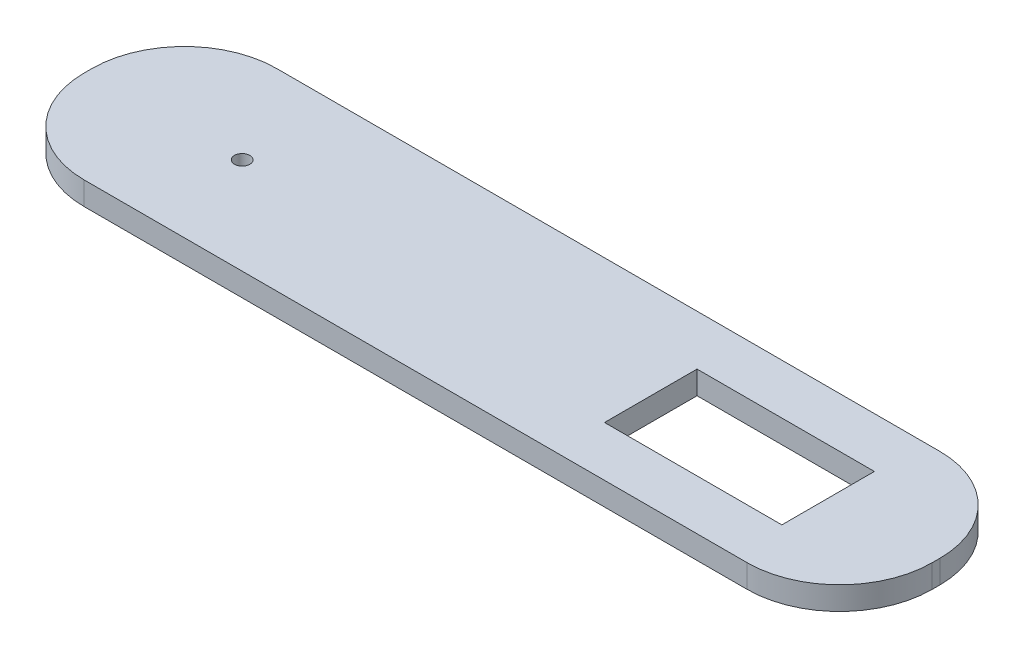
ISO-10303-21;
HEADER;
FILE_DESCRIPTION(('STEP AP214'),'2;1');
FILE_NAME('part.step','',(''),(''),'','','');
FILE_SCHEMA(('AUTOMOTIVE_DESIGN { 1 0 10303 214 1 1 1 1 }'));
ENDSEC;
DATA;
#1=APPLICATION_CONTEXT('core data for automotive mechanical design processes');
#2=APPLICATION_PROTOCOL_DEFINITION('international standard','automotive_design',2000,#1);
#3=PRODUCT_CONTEXT('',#1,'mechanical');
#4=PRODUCT('Part','Part','',(#3));
#5=PRODUCT_RELATED_PRODUCT_CATEGORY('part','',(#4));
#6=PRODUCT_DEFINITION_FORMATION('','',#4);
#7=PRODUCT_DEFINITION_CONTEXT('part definition',#1,'design');
#8=PRODUCT_DEFINITION('design','',#6,#7);
#9=PRODUCT_DEFINITION_SHAPE('','',#8);
#10=(LENGTH_UNIT() NAMED_UNIT(*) SI_UNIT(.MILLI.,.METRE.));
#11=(NAMED_UNIT(*) PLANE_ANGLE_UNIT() SI_UNIT($,.RADIAN.));
#12=(NAMED_UNIT(*) SI_UNIT($,.STERADIAN.) SOLID_ANGLE_UNIT());
#13=UNCERTAINTY_MEASURE_WITH_UNIT(LENGTH_MEASURE(1.E-05),#10,'distance_accuracy_value','');
#14=(GEOMETRIC_REPRESENTATION_CONTEXT(3) GLOBAL_UNCERTAINTY_ASSIGNED_CONTEXT((#13)) GLOBAL_UNIT_ASSIGNED_CONTEXT((#10,
#11,#12)) REPRESENTATION_CONTEXT('',''));
#15=CARTESIAN_POINT('',(0.,0.,0.));
#16=DIRECTION('',(0.,0.,1.));
#17=DIRECTION('',(1.,0.,0.));
#18=AXIS2_PLACEMENT_3D('',#15,#16,#17);
#19=CARTESIAN_POINT('',(0.,3.,0.));
#20=DIRECTION('',(1.,0.,0.));
#21=DIRECTION('',(0.,0.,-1.));
#22=AXIS2_PLACEMENT_3D('',#19,#20,#21);
#23=PLANE('',#22);
#24=DIRECTION('',(0.,0.,1.));
#25=VECTOR('',#24,1.);
#26=CARTESIAN_POINT('',(0.,3.,0.));
#27=LINE('',#26,#25);
#28=CARTESIAN_POINT('',(0.,3.,-13.));
#29=VERTEX_POINT('',#28);
#30=CARTESIAN_POINT('',(0.,3.,-12.));
#31=VERTEX_POINT('',#30);
#32=EDGE_CURVE('E191',#29,#31,#27,.T.);
#33=ORIENTED_EDGE('',*,*,#32,.F.);
#34=DIRECTION('',(0.,-1.,0.));
#35=VECTOR('',#34,1.);
#36=CARTESIAN_POINT('',(0.,3.,-13.));
#37=LINE('',#36,#35);
#38=CARTESIAN_POINT('',(0.,0.,-13.));
#39=VERTEX_POINT('',#38);
#40=EDGE_CURVE('E11',#29,#39,#37,.T.);
#41=ORIENTED_EDGE('',*,*,#40,.T.);
#42=DIRECTION('',(0.,0.,1.));
#43=VECTOR('',#42,1.);
#44=CARTESIAN_POINT('',(0.,0.,0.));
#45=LINE('',#44,#43);
#46=CARTESIAN_POINT('',(0.,0.,-12.));
#47=VERTEX_POINT('',#46);
#48=EDGE_CURVE('E185',#39,#47,#45,.T.);
#49=ORIENTED_EDGE('',*,*,#48,.T.);
#50=DIRECTION('',(0.,-1.,0.));
#51=VECTOR('',#50,1.);
#52=CARTESIAN_POINT('',(0.,3.,-12.));
#53=LINE('',#52,#51);
#54=EDGE_CURVE('E48',#47,#31,#53,.F.);
#55=ORIENTED_EDGE('',*,*,#54,.T.);
#56=EDGE_LOOP('',(#33,#41,#49,#55));
#57=FACE_BOUND('',#56,.T.);
#58=ADVANCED_FACE('F39',(#57),#23,.F.);
#59=CARTESIAN_POINT('',(0.,3.,0.));
#60=DIRECTION('',(0.,0.,-1.));
#61=DIRECTION('',(-1.,0.,0.));
#62=AXIS2_PLACEMENT_3D('',#59,#60,#61);
#63=PLANE('',#62);
#64=DIRECTION('',(1.,0.,0.));
#65=VECTOR('',#64,1.);
#66=CARTESIAN_POINT('',(0.,0.,0.));
#67=LINE('',#66,#65);
#68=CARTESIAN_POINT('',(12.,0.,0.));
#69=VERTEX_POINT('',#68);
#70=CARTESIAN_POINT('',(98.,0.,0.));
#71=VERTEX_POINT('',#70);
#72=EDGE_CURVE('E210',#69,#71,#67,.T.);
#73=ORIENTED_EDGE('',*,*,#72,.T.);
#74=DIRECTION('',(0.,-1.,0.));
#75=VECTOR('',#74,1.);
#76=CARTESIAN_POINT('',(98.,3.,0.));
#77=LINE('',#76,#75);
#78=CARTESIAN_POINT('',(98.,3.,0.));
#79=VERTEX_POINT('',#78);
#80=EDGE_CURVE('E55',#71,#79,#77,.F.);
#81=ORIENTED_EDGE('',*,*,#80,.T.);
#82=DIRECTION('',(1.,0.,0.));
#83=VECTOR('',#82,1.);
#84=CARTESIAN_POINT('',(0.,3.,0.));
#85=LINE('',#84,#83);
#86=CARTESIAN_POINT('',(12.,3.,0.));
#87=VERTEX_POINT('',#86);
#88=EDGE_CURVE('E194',#87,#79,#85,.T.);
#89=ORIENTED_EDGE('',*,*,#88,.F.);
#90=DIRECTION('',(0.,-1.,0.));
#91=VECTOR('',#90,1.);
#92=CARTESIAN_POINT('',(12.,3.,0.));
#93=LINE('',#92,#91);
#94=EDGE_CURVE('E256',#87,#69,#93,.T.);
#95=ORIENTED_EDGE('',*,*,#94,.T.);
#96=EDGE_LOOP('',(#73,#81,#89,#95));
#97=FACE_BOUND('',#96,.T.);
#98=ADVANCED_FACE('F272',(#97),#63,.F.);
#99=CARTESIAN_POINT('',(110.,3.,0.));
#100=DIRECTION('',(-1.,0.,0.));
#101=DIRECTION('',(0.,0.,1.));
#102=AXIS2_PLACEMENT_3D('',#99,#100,#101);
#103=PLANE('',#102);
#104=DIRECTION('',(0.,0.,-1.));
#105=VECTOR('',#104,1.);
#106=CARTESIAN_POINT('',(110.,0.,0.));
#107=LINE('',#106,#105);
#108=CARTESIAN_POINT('',(110.,0.,-12.));
#109=VERTEX_POINT('',#108);
#110=CARTESIAN_POINT('',(110.,0.,-13.));
#111=VERTEX_POINT('',#110);
#112=EDGE_CURVE('E213',#109,#111,#107,.T.);
#113=ORIENTED_EDGE('',*,*,#112,.T.);
#114=DIRECTION('',(0.,-1.,0.));
#115=VECTOR('',#114,1.);
#116=CARTESIAN_POINT('',(110.,3.,-13.));
#117=LINE('',#116,#115);
#118=CARTESIAN_POINT('',(110.,3.,-13.));
#119=VERTEX_POINT('',#118);
#120=EDGE_CURVE('E242',#111,#119,#117,.F.);
#121=ORIENTED_EDGE('',*,*,#120,.T.);
#122=DIRECTION('',(0.,0.,-1.));
#123=VECTOR('',#122,1.);
#124=CARTESIAN_POINT('',(110.,3.,0.));
#125=LINE('',#124,#123);
#126=CARTESIAN_POINT('',(110.,3.,-12.));
#127=VERTEX_POINT('',#126);
#128=EDGE_CURVE('E198',#127,#119,#125,.T.);
#129=ORIENTED_EDGE('',*,*,#128,.F.);
#130=DIRECTION('',(0.,-1.,0.));
#131=VECTOR('',#130,1.);
#132=CARTESIAN_POINT('',(110.,3.,-12.));
#133=LINE('',#132,#131);
#134=EDGE_CURVE('E238',#127,#109,#133,.T.);
#135=ORIENTED_EDGE('',*,*,#134,.T.);
#136=EDGE_LOOP('',(#113,#121,#129,#135));
#137=FACE_BOUND('',#136,.T.);
#138=ADVANCED_FACE('F281',(#137),#103,.F.);
#139=CARTESIAN_POINT('',(0.,3.,-25.));
#140=DIRECTION('',(0.,0.,1.));
#141=DIRECTION('',(1.,0.,0.));
#142=AXIS2_PLACEMENT_3D('',#139,#140,#141);
#143=PLANE('',#142);
#144=DIRECTION('',(-1.,0.,0.));
#145=VECTOR('',#144,1.);
#146=CARTESIAN_POINT('',(0.,3.,-25.));
#147=LINE('',#146,#145);
#148=CARTESIAN_POINT('',(98.,3.,-25.));
#149=VERTEX_POINT('',#148);
#150=CARTESIAN_POINT('',(12.,3.,-25.));
#151=VERTEX_POINT('',#150);
#152=EDGE_CURVE('E202',#149,#151,#147,.T.);
#153=ORIENTED_EDGE('',*,*,#152,.F.);
#154=DIRECTION('',(0.,-1.,0.));
#155=VECTOR('',#154,1.);
#156=CARTESIAN_POINT('',(98.,3.,-25.));
#157=LINE('',#156,#155);
#158=CARTESIAN_POINT('',(98.,0.,-25.));
#159=VERTEX_POINT('',#158);
#160=EDGE_CURVE('E222',#149,#159,#157,.T.);
#161=ORIENTED_EDGE('',*,*,#160,.T.);
#162=DIRECTION('',(-1.,0.,0.));
#163=VECTOR('',#162,1.);
#164=CARTESIAN_POINT('',(0.,0.,-25.));
#165=LINE('',#164,#163);
#166=CARTESIAN_POINT('',(12.,0.,-25.));
#167=VERTEX_POINT('',#166);
#168=EDGE_CURVE('E195',#159,#167,#165,.T.);
#169=ORIENTED_EDGE('',*,*,#168,.T.);
#170=DIRECTION('',(0.,-1.,0.));
#171=VECTOR('',#170,1.);
#172=CARTESIAN_POINT('',(12.,3.,-25.));
#173=LINE('',#172,#171);
#174=EDGE_CURVE('E206',#167,#151,#173,.F.);
#175=ORIENTED_EDGE('',*,*,#174,.T.);
#176=EDGE_LOOP('',(#153,#161,#169,#175));
#177=FACE_BOUND('',#176,.T.);
#178=ADVANCED_FACE('F289',(#177),#143,.F.);
#179=CARTESIAN_POINT('',(0.,3.,0.));
#180=DIRECTION('',(0.,-1.,0.));
#181=DIRECTION('',(0.,0.,-1.));
#182=AXIS2_PLACEMENT_3D('',#179,#180,#181);
#183=PLANE('',#182);
#184=CARTESIAN_POINT('',(20.,3.,-12.5));
#185=DIRECTION('',(0.,1.,0.));
#186=DIRECTION('',(0.,0.,1.));
#187=AXIS2_PLACEMENT_3D('',#184,#185,#186);
#188=CIRCLE('',#187,1.);
#189=CARTESIAN_POINT('',(20.,3.,-11.5));
#190=VERTEX_POINT('',#189);
#191=EDGE_CURVE('E166',#190,#190,#188,.T.);
#192=ORIENTED_EDGE('',*,*,#191,.F.);
#193=EDGE_LOOP('',(#192));
#194=FACE_BOUND('',#193,.T.);
#195=DIRECTION('',(1.,0.,0.));
#196=VECTOR('',#195,1.);
#197=CARTESIAN_POINT('',(73.,3.,-6.5));
#198=LINE('',#197,#196);
#199=CARTESIAN_POINT('',(73.,3.,-6.5));
#200=VERTEX_POINT('',#199);
#201=CARTESIAN_POINT('',(96.,3.,-6.5));
#202=VERTEX_POINT('',#201);
#203=EDGE_CURVE('E175',#200,#202,#198,.T.);
#204=ORIENTED_EDGE('',*,*,#203,.F.);
#205=DIRECTION('',(0.,0.,1.));
#206=VECTOR('',#205,1.);
#207=CARTESIAN_POINT('',(73.,3.,-18.5));
#208=LINE('',#207,#206);
#209=CARTESIAN_POINT('',(73.,3.,-18.5));
#210=VERTEX_POINT('',#209);
#211=EDGE_CURVE('E138',#210,#200,#208,.T.);
#212=ORIENTED_EDGE('',*,*,#211,.F.);
#213=DIRECTION('',(-1.,0.,0.));
#214=VECTOR('',#213,1.);
#215=CARTESIAN_POINT('',(73.,3.,-18.5));
#216=LINE('',#215,#214);
#217=CARTESIAN_POINT('',(96.,3.,-18.5));
#218=VERTEX_POINT('',#217);
#219=EDGE_CURVE('E159',#218,#210,#216,.T.);
#220=ORIENTED_EDGE('',*,*,#219,.F.);
#221=DIRECTION('',(0.,0.,-1.));
#222=VECTOR('',#221,1.);
#223=CARTESIAN_POINT('',(96.,3.,-18.5));
#224=LINE('',#223,#222);
#225=EDGE_CURVE('E163',#202,#218,#224,.T.);
#226=ORIENTED_EDGE('',*,*,#225,.F.);
#227=EDGE_LOOP('',(#204,#212,#220,#226));
#228=FACE_BOUND('',#227,.T.);
#229=ORIENTED_EDGE('',*,*,#128,.T.);
#230=CARTESIAN_POINT('',(98.,3.,-13.));
#231=DIRECTION('',(0.,-1.,0.));
#232=DIRECTION('',(0.,0.,-1.));
#233=AXIS2_PLACEMENT_3D('',#230,#231,#232);
#234=CIRCLE('',#233,12.);
#235=EDGE_CURVE('E253',#119,#149,#234,.F.);
#236=ORIENTED_EDGE('',*,*,#235,.T.);
#237=ORIENTED_EDGE('',*,*,#152,.T.);
#238=CARTESIAN_POINT('',(12.,3.,-13.));
#239=DIRECTION('',(0.,-1.,0.));
#240=DIRECTION('',(0.,0.,-1.));
#241=AXIS2_PLACEMENT_3D('',#238,#239,#240);
#242=CIRCLE('',#241,12.);
#243=EDGE_CURVE('E247',#151,#29,#242,.F.);
#244=ORIENTED_EDGE('',*,*,#243,.T.);
#245=ORIENTED_EDGE('',*,*,#32,.T.);
#246=CARTESIAN_POINT('',(12.,3.,-12.));
#247=DIRECTION('',(0.,-1.,0.));
#248=DIRECTION('',(0.,0.,-1.));
#249=AXIS2_PLACEMENT_3D('',#246,#247,#248);
#250=CIRCLE('',#249,12.);
#251=EDGE_CURVE('E62',#31,#87,#250,.F.);
#252=ORIENTED_EDGE('',*,*,#251,.T.);
#253=ORIENTED_EDGE('',*,*,#88,.T.);
#254=CARTESIAN_POINT('',(98.,3.,-12.));
#255=DIRECTION('',(0.,-1.,0.));
#256=DIRECTION('',(0.,0.,-1.));
#257=AXIS2_PLACEMENT_3D('',#254,#255,#256);
#258=CIRCLE('',#257,12.);
#259=EDGE_CURVE('E250',#79,#127,#258,.F.);
#260=ORIENTED_EDGE('',*,*,#259,.T.);
#261=EDGE_LOOP('',(#229,#236,#237,#244,#245,#252,#253,#260));
#262=FACE_BOUND('',#261,.T.);
#263=ADVANCED_FACE('F268',(#194,#228,#262),#183,.F.);
#264=CARTESIAN_POINT('',(0.,0.,0.));
#265=DIRECTION('',(0.,-1.,0.));
#266=DIRECTION('',(0.,0.,-1.));
#267=AXIS2_PLACEMENT_3D('',#264,#265,#266);
#268=PLANE('',#267);
#269=CARTESIAN_POINT('',(20.,0.,-12.5));
#270=DIRECTION('',(0.,1.,0.));
#271=DIRECTION('',(0.,0.,1.));
#272=AXIS2_PLACEMENT_3D('',#269,#270,#271);
#273=CIRCLE('',#272,1.);
#274=CARTESIAN_POINT('',(20.,0.,-11.5));
#275=VERTEX_POINT('',#274);
#276=EDGE_CURVE('E176',#275,#275,#273,.T.);
#277=ORIENTED_EDGE('',*,*,#276,.T.);
#278=EDGE_LOOP('',(#277));
#279=FACE_BOUND('',#278,.T.);
#280=DIRECTION('',(0.,0.,1.));
#281=VECTOR('',#280,1.);
#282=CARTESIAN_POINT('',(73.,0.,-18.5));
#283=LINE('',#282,#281);
#284=CARTESIAN_POINT('',(73.,0.,-18.5));
#285=VERTEX_POINT('',#284);
#286=CARTESIAN_POINT('',(73.,0.,-6.5));
#287=VERTEX_POINT('',#286);
#288=EDGE_CURVE('E135',#285,#287,#283,.T.);
#289=ORIENTED_EDGE('',*,*,#288,.T.);
#290=DIRECTION('',(1.,0.,0.));
#291=VECTOR('',#290,1.);
#292=CARTESIAN_POINT('',(73.,0.,-6.5));
#293=LINE('',#292,#291);
#294=CARTESIAN_POINT('',(96.,0.,-6.5));
#295=VERTEX_POINT('',#294);
#296=EDGE_CURVE('E148',#287,#295,#293,.T.);
#297=ORIENTED_EDGE('',*,*,#296,.T.);
#298=DIRECTION('',(0.,0.,-1.));
#299=VECTOR('',#298,1.);
#300=CARTESIAN_POINT('',(96.,0.,-18.5));
#301=LINE('',#300,#299);
#302=CARTESIAN_POINT('',(96.,0.,-18.5));
#303=VERTEX_POINT('',#302);
#304=EDGE_CURVE('E153',#295,#303,#301,.T.);
#305=ORIENTED_EDGE('',*,*,#304,.T.);
#306=DIRECTION('',(-1.,0.,0.));
#307=VECTOR('',#306,1.);
#308=CARTESIAN_POINT('',(73.,0.,-18.5));
#309=LINE('',#308,#307);
#310=EDGE_CURVE('E144',#303,#285,#309,.T.);
#311=ORIENTED_EDGE('',*,*,#310,.T.);
#312=EDGE_LOOP('',(#289,#297,#305,#311));
#313=FACE_BOUND('',#312,.T.);
#314=ORIENTED_EDGE('',*,*,#168,.F.);
#315=CARTESIAN_POINT('',(98.,0.,-13.));
#316=DIRECTION('',(0.,-1.,0.));
#317=DIRECTION('',(0.,0.,-1.));
#318=AXIS2_PLACEMENT_3D('',#315,#316,#317);
#319=CIRCLE('',#318,12.);
#320=EDGE_CURVE('E235',#159,#111,#319,.T.);
#321=ORIENTED_EDGE('',*,*,#320,.T.);
#322=ORIENTED_EDGE('',*,*,#112,.F.);
#323=CARTESIAN_POINT('',(98.,0.,-12.));
#324=DIRECTION('',(0.,-1.,0.));
#325=DIRECTION('',(0.,0.,-1.));
#326=AXIS2_PLACEMENT_3D('',#323,#324,#325);
#327=CIRCLE('',#326,12.);
#328=EDGE_CURVE('E232',#109,#71,#327,.T.);
#329=ORIENTED_EDGE('',*,*,#328,.T.);
#330=ORIENTED_EDGE('',*,*,#72,.F.);
#331=CARTESIAN_POINT('',(12.,0.,-12.));
#332=DIRECTION('',(0.,-1.,0.));
#333=DIRECTION('',(0.,0.,-1.));
#334=AXIS2_PLACEMENT_3D('',#331,#332,#333);
#335=CIRCLE('',#334,12.);
#336=EDGE_CURVE('E226',#69,#47,#335,.T.);
#337=ORIENTED_EDGE('',*,*,#336,.T.);
#338=ORIENTED_EDGE('',*,*,#48,.F.);
#339=CARTESIAN_POINT('',(12.,0.,-13.));
#340=DIRECTION('',(0.,-1.,0.));
#341=DIRECTION('',(0.,0.,-1.));
#342=AXIS2_PLACEMENT_3D('',#339,#340,#341);
#343=CIRCLE('',#342,12.);
#344=EDGE_CURVE('E229',#39,#167,#343,.T.);
#345=ORIENTED_EDGE('',*,*,#344,.T.);
#346=EDGE_LOOP('',(#314,#321,#322,#329,#330,#337,#338,#345));
#347=FACE_BOUND('',#346,.T.);
#348=ADVANCED_FACE('F155',(#279,#313,#347),#268,.T.);
#349=CARTESIAN_POINT('',(73.,0.,-18.5));
#350=DIRECTION('',(-1.,0.,0.));
#351=DIRECTION('',(0.,0.,1.));
#352=AXIS2_PLACEMENT_3D('',#349,#350,#351);
#353=PLANE('',#352);
#354=ORIENTED_EDGE('',*,*,#211,.T.);
#355=DIRECTION('',(0.,1.,0.));
#356=VECTOR('',#355,1.);
#357=CARTESIAN_POINT('',(73.,0.,-6.5));
#358=LINE('',#357,#356);
#359=EDGE_CURVE('E131',#287,#200,#358,.T.);
#360=ORIENTED_EDGE('',*,*,#359,.F.);
#361=ORIENTED_EDGE('',*,*,#288,.F.);
#362=DIRECTION('',(0.,1.,0.));
#363=VECTOR('',#362,1.);
#364=CARTESIAN_POINT('',(73.,0.,-18.5));
#365=LINE('',#364,#363);
#366=EDGE_CURVE('E182',#285,#210,#365,.T.);
#367=ORIENTED_EDGE('',*,*,#366,.T.);
#368=EDGE_LOOP('',(#354,#360,#361,#367));
#369=FACE_BOUND('',#368,.T.);
#370=ADVANCED_FACE('F133',(#369),#353,.F.);
#371=CARTESIAN_POINT('',(73.,0.,-18.5));
#372=DIRECTION('',(0.,0.,-1.));
#373=DIRECTION('',(-1.,0.,0.));
#374=AXIS2_PLACEMENT_3D('',#371,#372,#373);
#375=PLANE('',#374);
#376=ORIENTED_EDGE('',*,*,#219,.T.);
#377=ORIENTED_EDGE('',*,*,#366,.F.);
#378=ORIENTED_EDGE('',*,*,#310,.F.);
#379=DIRECTION('',(0.,1.,0.));
#380=VECTOR('',#379,1.);
#381=CARTESIAN_POINT('',(96.,0.,-18.5));
#382=LINE('',#381,#380);
#383=EDGE_CURVE('E186',#303,#218,#382,.T.);
#384=ORIENTED_EDGE('',*,*,#383,.T.);
#385=EDGE_LOOP('',(#376,#377,#378,#384));
#386=FACE_BOUND('',#385,.T.);
#387=ADVANCED_FACE('F322',(#386),#375,.F.);
#388=CARTESIAN_POINT('',(96.,0.,-18.5));
#389=DIRECTION('',(1.,0.,0.));
#390=DIRECTION('',(0.,0.,-1.));
#391=AXIS2_PLACEMENT_3D('',#388,#389,#390);
#392=PLANE('',#391);
#393=ORIENTED_EDGE('',*,*,#225,.T.);
#394=ORIENTED_EDGE('',*,*,#383,.F.);
#395=ORIENTED_EDGE('',*,*,#304,.F.);
#396=DIRECTION('',(0.,1.,0.));
#397=VECTOR('',#396,1.);
#398=CARTESIAN_POINT('',(96.,0.,-6.5));
#399=LINE('',#398,#397);
#400=EDGE_CURVE('E143',#295,#202,#399,.T.);
#401=ORIENTED_EDGE('',*,*,#400,.T.);
#402=EDGE_LOOP('',(#393,#394,#395,#401));
#403=FACE_BOUND('',#402,.T.);
#404=ADVANCED_FACE('F317',(#403),#392,.F.);
#405=CARTESIAN_POINT('',(73.,0.,-6.5));
#406=DIRECTION('',(0.,0.,1.));
#407=DIRECTION('',(1.,0.,0.));
#408=AXIS2_PLACEMENT_3D('',#405,#406,#407);
#409=PLANE('',#408);
#410=ORIENTED_EDGE('',*,*,#203,.T.);
#411=ORIENTED_EDGE('',*,*,#400,.F.);
#412=ORIENTED_EDGE('',*,*,#296,.F.);
#413=ORIENTED_EDGE('',*,*,#359,.T.);
#414=EDGE_LOOP('',(#410,#411,#412,#413));
#415=FACE_BOUND('',#414,.T.);
#416=ADVANCED_FACE('F149',(#415),#409,.F.);
#417=CARTESIAN_POINT('',(20.,0.,-12.5));
#418=DIRECTION('',(0.,1.,0.));
#419=DIRECTION('',(0.,0.,1.));
#420=AXIS2_PLACEMENT_3D('',#417,#418,#419);
#421=CYLINDRICAL_SURFACE('',#420,1.);
#422=ORIENTED_EDGE('',*,*,#276,.F.);
#423=EDGE_LOOP('',(#422));
#424=FACE_BOUND('',#423,.T.);
#425=ORIENTED_EDGE('',*,*,#191,.T.);
#426=EDGE_LOOP('',(#425));
#427=FACE_BOUND('',#426,.T.);
#428=ADVANCED_FACE('F308',(#424,#427),#421,.F.);
#429=CARTESIAN_POINT('',(98.,3.,-13.));
#430=DIRECTION('',(0.,-1.,0.));
#431=DIRECTION('',(0.,0.,-1.));
#432=AXIS2_PLACEMENT_3D('',#429,#430,#431);
#433=CYLINDRICAL_SURFACE('',#432,12.);
#434=ORIENTED_EDGE('',*,*,#235,.F.);
#435=ORIENTED_EDGE('',*,*,#120,.F.);
#436=ORIENTED_EDGE('',*,*,#320,.F.);
#437=ORIENTED_EDGE('',*,*,#160,.F.);
#438=EDGE_LOOP('',(#434,#435,#436,#437));
#439=FACE_BOUND('',#438,.T.);
#440=ADVANCED_FACE('F287',(#439),#433,.T.);
#441=CARTESIAN_POINT('',(98.,3.,-12.));
#442=DIRECTION('',(0.,-1.,0.));
#443=DIRECTION('',(0.,0.,-1.));
#444=AXIS2_PLACEMENT_3D('',#441,#442,#443);
#445=CYLINDRICAL_SURFACE('',#444,12.);
#446=ORIENTED_EDGE('',*,*,#259,.F.);
#447=ORIENTED_EDGE('',*,*,#80,.F.);
#448=ORIENTED_EDGE('',*,*,#328,.F.);
#449=ORIENTED_EDGE('',*,*,#134,.F.);
#450=EDGE_LOOP('',(#446,#447,#448,#449));
#451=FACE_BOUND('',#450,.T.);
#452=ADVANCED_FACE('F278',(#451),#445,.T.);
#453=CARTESIAN_POINT('',(12.,3.,-13.));
#454=DIRECTION('',(0.,-1.,0.));
#455=DIRECTION('',(0.,0.,-1.));
#456=AXIS2_PLACEMENT_3D('',#453,#454,#455);
#457=CYLINDRICAL_SURFACE('',#456,12.);
#458=ORIENTED_EDGE('',*,*,#243,.F.);
#459=ORIENTED_EDGE('',*,*,#174,.F.);
#460=ORIENTED_EDGE('',*,*,#344,.F.);
#461=ORIENTED_EDGE('',*,*,#40,.F.);
#462=EDGE_LOOP('',(#458,#459,#460,#461));
#463=FACE_BOUND('',#462,.T.);
#464=ADVANCED_FACE('F292',(#463),#457,.T.);
#465=CARTESIAN_POINT('',(12.,3.,-12.));
#466=DIRECTION('',(0.,-1.,0.));
#467=DIRECTION('',(0.,0.,-1.));
#468=AXIS2_PLACEMENT_3D('',#465,#466,#467);
#469=CYLINDRICAL_SURFACE('',#468,12.);
#470=ORIENTED_EDGE('',*,*,#251,.F.);
#471=ORIENTED_EDGE('',*,*,#54,.F.);
#472=ORIENTED_EDGE('',*,*,#336,.F.);
#473=ORIENTED_EDGE('',*,*,#94,.F.);
#474=EDGE_LOOP('',(#470,#471,#472,#473));
#475=FACE_BOUND('',#474,.T.);
#476=ADVANCED_FACE('F41',(#475),#469,.T.);
#477=CLOSED_SHELL('',(#58,#98,#138,#178,#263,#348,#370,#387,#404,#416,#428,#440,#452,#464,#476));
#478=MANIFOLD_SOLID_BREP('B2',#477);
#479=ADVANCED_BREP_SHAPE_REPRESENTATION('',(#18,#478),#14);
#480=SHAPE_DEFINITION_REPRESENTATION(#9,#479);
ENDSEC;
END-ISO-10303-21;
